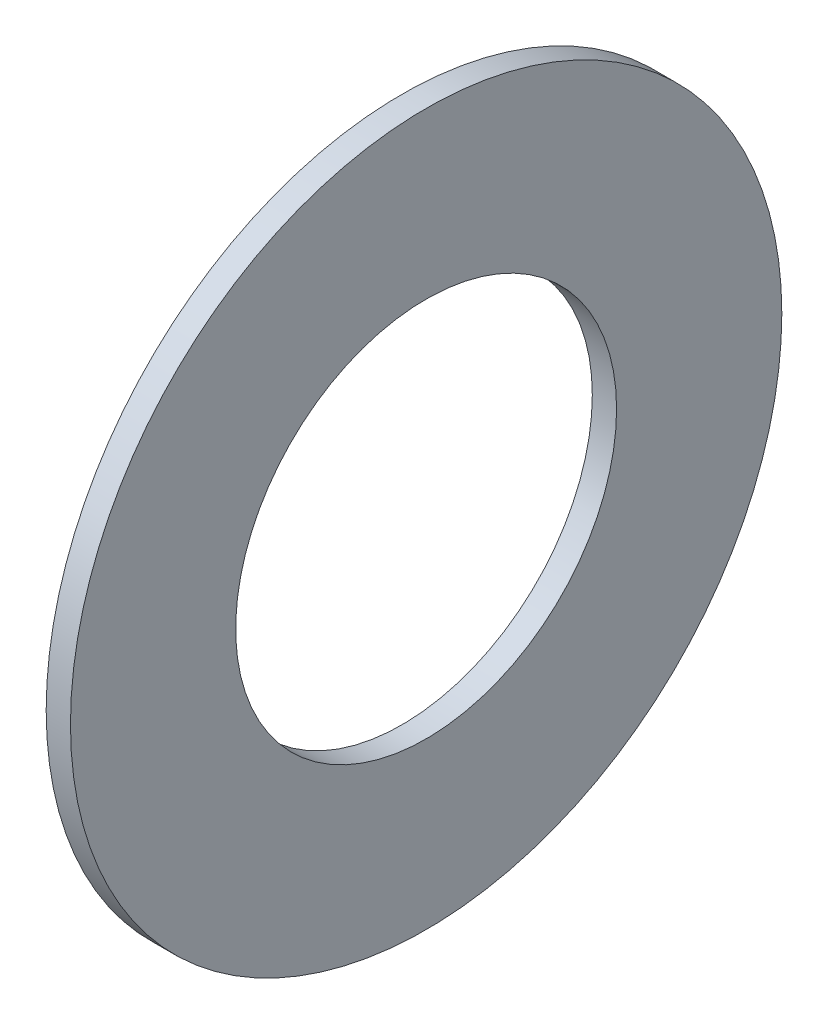
ISO-10303-21;
HEADER;
FILE_DESCRIPTION(('STEP AP214'),'2;1');
FILE_NAME('part.step','',(''),(''),'','','');
FILE_SCHEMA(('AUTOMOTIVE_DESIGN { 1 0 10303 214 1 1 1 1 }'));
ENDSEC;
DATA;
#1=APPLICATION_CONTEXT('core data for automotive mechanical design processes');
#2=APPLICATION_PROTOCOL_DEFINITION('international standard','automotive_design',2000,#1);
#3=PRODUCT_CONTEXT('',#1,'mechanical');
#4=PRODUCT('Part','Part','',(#3));
#5=PRODUCT_RELATED_PRODUCT_CATEGORY('part','',(#4));
#6=PRODUCT_DEFINITION_FORMATION('','',#4);
#7=PRODUCT_DEFINITION_CONTEXT('part definition',#1,'design');
#8=PRODUCT_DEFINITION('design','',#6,#7);
#9=PRODUCT_DEFINITION_SHAPE('','',#8);
#10=(LENGTH_UNIT() NAMED_UNIT(*) SI_UNIT(.MILLI.,.METRE.));
#11=(NAMED_UNIT(*) PLANE_ANGLE_UNIT() SI_UNIT($,.RADIAN.));
#12=(NAMED_UNIT(*) SI_UNIT($,.STERADIAN.) SOLID_ANGLE_UNIT());
#13=UNCERTAINTY_MEASURE_WITH_UNIT(LENGTH_MEASURE(1.E-05),#10,'distance_accuracy_value','');
#14=(GEOMETRIC_REPRESENTATION_CONTEXT(3) GLOBAL_UNCERTAINTY_ASSIGNED_CONTEXT((#13)) GLOBAL_UNIT_ASSIGNED_CONTEXT((#10,
#11,#12)) REPRESENTATION_CONTEXT('',''));
#15=CARTESIAN_POINT('',(0.,0.,0.));
#16=DIRECTION('',(0.,0.,1.));
#17=DIRECTION('',(1.,0.,0.));
#18=AXIS2_PLACEMENT_3D('',#15,#16,#17);
#19=CARTESIAN_POINT('',(0.8128,0.,0.));
#20=DIRECTION('',(1.,0.,0.));
#21=DIRECTION('',(0.,0.,-1.));
#22=AXIS2_PLACEMENT_3D('',#19,#20,#21);
#23=PLANE('',#22);
#24=CARTESIAN_POINT('',(0.8128,0.,0.));
#25=DIRECTION('',(1.,0.,0.));
#26=DIRECTION('',(0.,0.,-1.));
#27=AXIS2_PLACEMENT_3D('',#24,#25,#26);
#28=CIRCLE('',#27,11.90625);
#29=CARTESIAN_POINT('',(0.8128,0.,-11.90625));
#30=VERTEX_POINT('',#29);
#31=EDGE_CURVE('E10',#30,#30,#28,.T.);
#32=ORIENTED_EDGE('',*,*,#31,.T.);
#33=EDGE_LOOP('',(#32));
#34=FACE_BOUND('',#33,.T.);
#35=CARTESIAN_POINT('',(0.8128,0.,0.));
#36=DIRECTION('',(1.,0.,0.));
#37=DIRECTION('',(0.,0.,-1.));
#38=AXIS2_PLACEMENT_3D('',#35,#36,#37);
#39=CIRCLE('',#38,6.3754);
#40=CARTESIAN_POINT('',(0.8128,0.,-6.3754));
#41=VERTEX_POINT('',#40);
#42=EDGE_CURVE('E45',#41,#41,#39,.T.);
#43=ORIENTED_EDGE('',*,*,#42,.F.);
#44=EDGE_LOOP('',(#43));
#45=FACE_BOUND('',#44,.T.);
#46=ADVANCED_FACE('F34',(#34,#45),#23,.T.);
#47=CARTESIAN_POINT('',(0.,0.,0.));
#48=DIRECTION('',(1.,0.,0.));
#49=DIRECTION('',(0.,0.,-1.));
#50=AXIS2_PLACEMENT_3D('',#47,#48,#49);
#51=PLANE('',#50);
#52=CARTESIAN_POINT('',(0.,0.,0.));
#53=DIRECTION('',(1.,0.,0.));
#54=DIRECTION('',(0.,0.,-1.));
#55=AXIS2_PLACEMENT_3D('',#52,#53,#54);
#56=CIRCLE('',#55,11.90625);
#57=CARTESIAN_POINT('',(0.,0.,-11.90625));
#58=VERTEX_POINT('',#57);
#59=EDGE_CURVE('E38',#58,#58,#56,.T.);
#60=ORIENTED_EDGE('',*,*,#59,.F.);
#61=EDGE_LOOP('',(#60));
#62=FACE_BOUND('',#61,.T.);
#63=CARTESIAN_POINT('',(0.,0.,0.));
#64=DIRECTION('',(1.,0.,0.));
#65=DIRECTION('',(0.,0.,-1.));
#66=AXIS2_PLACEMENT_3D('',#63,#64,#65);
#67=CIRCLE('',#66,6.3754);
#68=CARTESIAN_POINT('',(0.,0.,-6.3754));
#69=VERTEX_POINT('',#68);
#70=EDGE_CURVE('E47',#69,#69,#67,.T.);
#71=ORIENTED_EDGE('',*,*,#70,.T.);
#72=EDGE_LOOP('',(#71));
#73=FACE_BOUND('',#72,.T.);
#74=ADVANCED_FACE('F57',(#62,#73),#51,.F.);
#75=CARTESIAN_POINT('',(0.8128,0.,0.));
#76=DIRECTION('',(-1.,0.,0.));
#77=DIRECTION('',(0.,0.,1.));
#78=AXIS2_PLACEMENT_3D('',#75,#76,#77);
#79=CYLINDRICAL_SURFACE('',#78,11.90625);
#80=ORIENTED_EDGE('',*,*,#31,.F.);
#81=EDGE_LOOP('',(#80));
#82=FACE_BOUND('',#81,.T.);
#83=ORIENTED_EDGE('',*,*,#59,.T.);
#84=EDGE_LOOP('',(#83));
#85=FACE_BOUND('',#84,.T.);
#86=ADVANCED_FACE('F36',(#82,#85),#79,.T.);
#87=CARTESIAN_POINT('',(0.8128,0.,0.));
#88=DIRECTION('',(-1.,0.,0.));
#89=DIRECTION('',(0.,0.,1.));
#90=AXIS2_PLACEMENT_3D('',#87,#88,#89);
#91=CYLINDRICAL_SURFACE('',#90,6.3754);
#92=ORIENTED_EDGE('',*,*,#42,.T.);
#93=EDGE_LOOP('',(#92));
#94=FACE_BOUND('',#93,.T.);
#95=ORIENTED_EDGE('',*,*,#70,.F.);
#96=EDGE_LOOP('',(#95));
#97=FACE_BOUND('',#96,.T.);
#98=ADVANCED_FACE('F53',(#94,#97),#91,.F.);
#99=CLOSED_SHELL('',(#46,#74,#86,#98));
#100=MANIFOLD_SOLID_BREP('B2',#99);
#101=ADVANCED_BREP_SHAPE_REPRESENTATION('',(#18,#100),#14);
#102=SHAPE_DEFINITION_REPRESENTATION(#9,#101);
ENDSEC;
END-ISO-10303-21;
